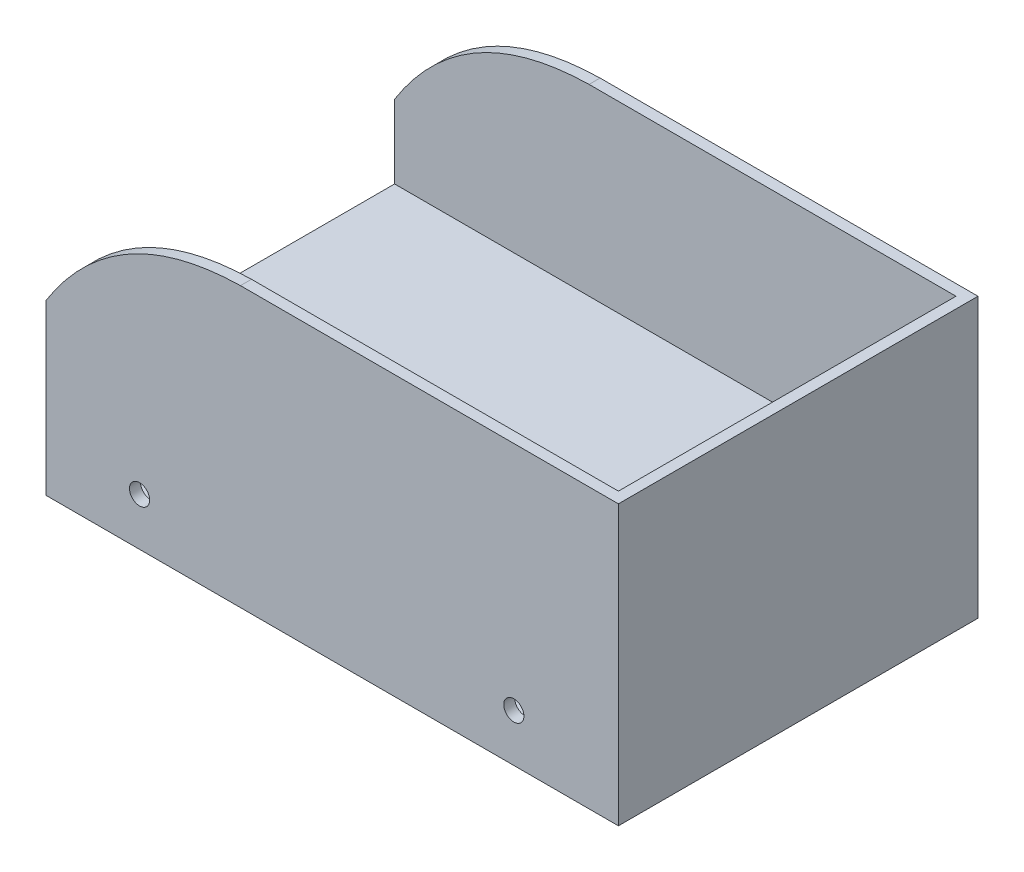
ISO-10303-21;
HEADER;
FILE_DESCRIPTION(('STEP AP214'),'2;1');
FILE_NAME('part.step','',(''),(''),'','','');
FILE_SCHEMA(('AUTOMOTIVE_DESIGN { 1 0 10303 214 1 1 1 1 }'));
ENDSEC;
DATA;
#1=APPLICATION_CONTEXT('core data for automotive mechanical design processes');
#2=APPLICATION_PROTOCOL_DEFINITION('international standard','automotive_design',2000,#1);
#3=PRODUCT_CONTEXT('',#1,'mechanical');
#4=PRODUCT('Part','Part','',(#3));
#5=PRODUCT_RELATED_PRODUCT_CATEGORY('part','',(#4));
#6=PRODUCT_DEFINITION_FORMATION('','',#4);
#7=PRODUCT_DEFINITION_CONTEXT('part definition',#1,'design');
#8=PRODUCT_DEFINITION('design','',#6,#7);
#9=PRODUCT_DEFINITION_SHAPE('','',#8);
#10=(LENGTH_UNIT() NAMED_UNIT(*) SI_UNIT(.MILLI.,.METRE.));
#11=(NAMED_UNIT(*) PLANE_ANGLE_UNIT() SI_UNIT($,.RADIAN.));
#12=(NAMED_UNIT(*) SI_UNIT($,.STERADIAN.) SOLID_ANGLE_UNIT());
#13=UNCERTAINTY_MEASURE_WITH_UNIT(LENGTH_MEASURE(1.E-05),#10,'distance_accuracy_value','');
#14=(GEOMETRIC_REPRESENTATION_CONTEXT(3) GLOBAL_UNCERTAINTY_ASSIGNED_CONTEXT((#13)) GLOBAL_UNIT_ASSIGNED_CONTEXT((#10,
#11,#12)) REPRESENTATION_CONTEXT('',''));
#15=CARTESIAN_POINT('',(0.,0.,0.));
#16=DIRECTION('',(0.,0.,1.));
#17=DIRECTION('',(1.,0.,0.));
#18=AXIS2_PLACEMENT_3D('',#15,#16,#17);
#19=CARTESIAN_POINT('',(765.,0.,0.));
#20=DIRECTION('',(-1.,0.,0.));
#21=DIRECTION('',(0.,0.,1.));
#22=AXIS2_PLACEMENT_3D('',#19,#20,#21);
#23=PLANE('',#22);
#24=DIRECTION('',(0.,-1.,0.));
#25=VECTOR('',#24,1.);
#26=CARTESIAN_POINT('',(765.,-29.9999999999998,-260.));
#27=LINE('',#26,#25);
#28=CARTESIAN_POINT('',(765.,-29.9999999999998,-260.));
#29=VERTEX_POINT('',#28);
#30=CARTESIAN_POINT('',(765.,-230.,-260.));
#31=VERTEX_POINT('',#30);
#32=EDGE_CURVE('E284',#29,#31,#27,.T.);
#33=ORIENTED_EDGE('',*,*,#32,.F.);
#34=DIRECTION('',(0.,0.,1.));
#35=VECTOR('',#34,1.);
#36=CARTESIAN_POINT('',(765.,-29.9999999999997,0.));
#37=LINE('',#36,#35);
#38=CARTESIAN_POINT('',(765.,-29.9999999999998,-660.));
#39=VERTEX_POINT('',#38);
#40=EDGE_CURVE('E338',#39,#29,#37,.T.);
#41=ORIENTED_EDGE('',*,*,#40,.F.);
#42=DIRECTION('',(0.,1.,0.));
#43=VECTOR('',#42,1.);
#44=CARTESIAN_POINT('',(765.,-29.9999999999998,-660.));
#45=LINE('',#44,#43);
#46=CARTESIAN_POINT('',(765.,-230.,-660.));
#47=VERTEX_POINT('',#46);
#48=EDGE_CURVE('E306',#47,#39,#45,.T.);
#49=ORIENTED_EDGE('',*,*,#48,.F.);
#50=DIRECTION('',(0.,0.,1.));
#51=VECTOR('',#50,1.);
#52=CARTESIAN_POINT('',(765.,-230.,30.));
#53=LINE('',#52,#51);
#54=EDGE_CURVE('E529',#47,#31,#53,.T.);
#55=ORIENTED_EDGE('',*,*,#54,.T.);
#56=EDGE_LOOP('',(#33,#41,#49,#55));
#57=FACE_BOUND('',#56,.T.);
#58=ADVANCED_FACE('F39',(#57),#23,.T.);
#59=CARTESIAN_POINT('',(0.,-230.,0.));
#60=DIRECTION('',(0.,-1.,0.));
#61=DIRECTION('',(1.,0.,0.));
#62=AXIS2_PLACEMENT_3D('',#59,#60,#61);
#63=PLANE('',#62);
#64=DIRECTION('',(1.,0.,0.));
#65=VECTOR('',#64,1.);
#66=CARTESIAN_POINT('',(-35.,-230.,-405.));
#67=LINE('',#66,#65);
#68=CARTESIAN_POINT('',(-35.,-230.,-405.));
#69=VERTEX_POINT('',#68);
#70=CARTESIAN_POINT('',(265.,-230.,-405.));
#71=VERTEX_POINT('',#70);
#72=EDGE_CURVE('E61',#69,#71,#67,.T.);
#73=ORIENTED_EDGE('',*,*,#72,.F.);
#74=DIRECTION('',(0.,0.,1.));
#75=VECTOR('',#74,1.);
#76=CARTESIAN_POINT('',(-35.,-230.,-515.));
#77=LINE('',#76,#75);
#78=CARTESIAN_POINT('',(-35.,-230.,-515.));
#79=VERTEX_POINT('',#78);
#80=EDGE_CURVE('E56',#79,#69,#77,.T.);
#81=ORIENTED_EDGE('',*,*,#80,.F.);
#82=DIRECTION('',(1.,0.,0.));
#83=VECTOR('',#82,1.);
#84=CARTESIAN_POINT('',(-35.,-230.,-515.));
#85=LINE('',#84,#83);
#86=CARTESIAN_POINT('',(265.,-230.,-515.));
#87=VERTEX_POINT('',#86);
#88=EDGE_CURVE('E245',#79,#87,#85,.T.);
#89=ORIENTED_EDGE('',*,*,#88,.T.);
#90=DIRECTION('',(0.,0.,1.));
#91=VECTOR('',#90,1.);
#92=CARTESIAN_POINT('',(265.,-230.,-515.));
#93=LINE('',#92,#91);
#94=EDGE_CURVE('E238',#87,#71,#93,.T.);
#95=ORIENTED_EDGE('',*,*,#94,.T.);
#96=EDGE_LOOP('',(#73,#81,#89,#95));
#97=FACE_BOUND('',#96,.T.);
#98=DIRECTION('',(0.,0.,-1.));
#99=VECTOR('',#98,1.);
#100=CARTESIAN_POINT('',(-765.,-230.,30.));
#101=LINE('',#100,#99);
#102=CARTESIAN_POINT('',(-765.,-230.,-260.));
#103=VERTEX_POINT('',#102);
#104=CARTESIAN_POINT('',(-765.,-230.,-660.));
#105=VERTEX_POINT('',#104);
#106=EDGE_CURVE('E526',#103,#105,#101,.T.);
#107=ORIENTED_EDGE('',*,*,#106,.F.);
#108=DIRECTION('',(-1.,0.,0.));
#109=VECTOR('',#108,1.);
#110=CARTESIAN_POINT('',(765.,-230.,-260.));
#111=LINE('',#110,#109);
#112=EDGE_CURVE('E289',#31,#103,#111,.T.);
#113=ORIENTED_EDGE('',*,*,#112,.F.);
#114=ORIENTED_EDGE('',*,*,#54,.F.);
#115=DIRECTION('',(-1.,0.,0.));
#116=VECTOR('',#115,1.);
#117=CARTESIAN_POINT('',(765.,-230.,-660.));
#118=LINE('',#117,#116);
#119=EDGE_CURVE('E320',#47,#105,#118,.T.);
#120=ORIENTED_EDGE('',*,*,#119,.T.);
#121=EDGE_LOOP('',(#107,#113,#114,#120));
#122=FACE_BOUND('',#121,.T.);
#123=ADVANCED_FACE('F397',(#97,#122),#63,.F.);
#124=CARTESIAN_POINT('',(-765.,-29.9999999999997,0.));
#125=DIRECTION('',(0.,1.,0.));
#126=DIRECTION('',(0.,0.,1.));
#127=AXIS2_PLACEMENT_3D('',#124,#125,#126);
#128=PLANE('',#127);
#129=ORIENTED_EDGE('',*,*,#40,.T.);
#130=DIRECTION('',(-1.,0.,0.));
#131=VECTOR('',#130,1.);
#132=CARTESIAN_POINT('',(765.,-29.9999999999998,-260.));
#133=LINE('',#132,#131);
#134=CARTESIAN_POINT('',(-765.,-29.9999999999998,-260.));
#135=VERTEX_POINT('',#134);
#136=EDGE_CURVE('E293',#29,#135,#133,.T.);
#137=ORIENTED_EDGE('',*,*,#136,.T.);
#138=DIRECTION('',(0.,0.,1.));
#139=VECTOR('',#138,1.);
#140=CARTESIAN_POINT('',(-765.,-29.9999999999997,0.));
#141=LINE('',#140,#139);
#142=CARTESIAN_POINT('',(-765.,-29.9999999999998,-660.));
#143=VERTEX_POINT('',#142);
#144=EDGE_CURVE('E333',#143,#135,#141,.T.);
#145=ORIENTED_EDGE('',*,*,#144,.F.);
#146=DIRECTION('',(-1.,0.,0.));
#147=VECTOR('',#146,1.);
#148=CARTESIAN_POINT('',(765.,-29.9999999999998,-660.));
#149=LINE('',#148,#147);
#150=EDGE_CURVE('E317',#39,#143,#149,.T.);
#151=ORIENTED_EDGE('',*,*,#150,.F.);
#152=EDGE_LOOP('',(#129,#137,#145,#151));
#153=FACE_BOUND('',#152,.T.);
#154=ADVANCED_FACE('F569',(#153),#128,.F.);
#155=DIRECTION('',(0.,-1.,0.));
#156=VECTOR('',#155,1.);
#157=CARTESIAN_POINT('',(765.,-29.9999999999998,-680.));
#158=LINE('',#157,#156);
#159=CARTESIAN_POINT('',(765.,-29.9999999999998,-680.));
#160=VERTEX_POINT('',#159);
#161=CARTESIAN_POINT('',(765.,-230.,-680.));
#162=VERTEX_POINT('',#161);
#163=EDGE_CURVE('E304',#160,#162,#158,.T.);
#164=ORIENTED_EDGE('',*,*,#163,.F.);
#165=CARTESIAN_POINT('',(765.,-29.9999999999998,-920.));
#166=VERTEX_POINT('',#165);
#167=EDGE_CURVE('E328',#166,#160,#37,.T.);
#168=ORIENTED_EDGE('',*,*,#167,.F.);
#169=DIRECTION('',(0.,1.,0.));
#170=VECTOR('',#169,1.);
#171=CARTESIAN_POINT('',(765.,0.,-920.));
#172=LINE('',#171,#170);
#173=CARTESIAN_POINT('',(765.,-230.,-920.));
#174=VERTEX_POINT('',#173);
#175=EDGE_CURVE('E476',#174,#166,#172,.T.);
#176=ORIENTED_EDGE('',*,*,#175,.F.);
#177=EDGE_CURVE('E517',#174,#162,#53,.T.);
#178=ORIENTED_EDGE('',*,*,#177,.T.);
#179=EDGE_LOOP('',(#164,#168,#176,#178));
#180=FACE_BOUND('',#179,.T.);
#181=ADVANCED_FACE('F592',(#180),#23,.T.);
#182=CARTESIAN_POINT('',(-765.,-230.,-680.));
#183=VERTEX_POINT('',#182);
#184=CARTESIAN_POINT('',(-765.,-230.,-920.));
#185=VERTEX_POINT('',#184);
#186=EDGE_CURVE('E512',#183,#185,#101,.T.);
#187=ORIENTED_EDGE('',*,*,#186,.F.);
#188=DIRECTION('',(-1.,0.,0.));
#189=VECTOR('',#188,1.);
#190=CARTESIAN_POINT('',(765.,-230.,-680.));
#191=LINE('',#190,#189);
#192=EDGE_CURVE('E309',#162,#183,#191,.T.);
#193=ORIENTED_EDGE('',*,*,#192,.F.);
#194=ORIENTED_EDGE('',*,*,#177,.F.);
#195=DIRECTION('',(1.,0.,0.));
#196=VECTOR('',#195,1.);
#197=CARTESIAN_POINT('',(0.,-230.,-920.));
#198=LINE('',#197,#196);
#199=EDGE_CURVE('E479',#185,#174,#198,.T.);
#200=ORIENTED_EDGE('',*,*,#199,.F.);
#201=EDGE_LOOP('',(#187,#193,#194,#200));
#202=FACE_BOUND('',#201,.T.);
#203=ADVANCED_FACE('F398',(#202),#63,.F.);
#204=ORIENTED_EDGE('',*,*,#167,.T.);
#205=DIRECTION('',(-1.,0.,0.));
#206=VECTOR('',#205,1.);
#207=CARTESIAN_POINT('',(765.,-29.9999999999998,-680.));
#208=LINE('',#207,#206);
#209=CARTESIAN_POINT('',(-765.,-29.9999999999998,-680.));
#210=VERTEX_POINT('',#209);
#211=EDGE_CURVE('E313',#160,#210,#208,.T.);
#212=ORIENTED_EDGE('',*,*,#211,.T.);
#213=CARTESIAN_POINT('',(-765.,-29.9999999999998,-920.));
#214=VERTEX_POINT('',#213);
#215=EDGE_CURVE('E329',#214,#210,#141,.T.);
#216=ORIENTED_EDGE('',*,*,#215,.F.);
#217=DIRECTION('',(1.,0.,0.));
#218=VECTOR('',#217,1.);
#219=CARTESIAN_POINT('',(-765.,-29.9999999999998,-920.));
#220=LINE('',#219,#218);
#221=EDGE_CURVE('E341',#214,#166,#220,.T.);
#222=ORIENTED_EDGE('',*,*,#221,.T.);
#223=EDGE_LOOP('',(#204,#212,#216,#222));
#224=FACE_BOUND('',#223,.T.);
#225=ADVANCED_FACE('F386',(#224),#128,.F.);
#226=CARTESIAN_POINT('',(765.,1.64888250634733E-13,-920.));
#227=VERTEX_POINT('',#226);
#228=CARTESIAN_POINT('',(765.,500.,-920.));
#229=VERTEX_POINT('',#228);
#230=EDGE_CURVE('E471',#227,#229,#172,.T.);
#231=ORIENTED_EDGE('',*,*,#230,.F.);
#232=DIRECTION('',(0.,0.,-1.));
#233=VECTOR('',#232,1.);
#234=CARTESIAN_POINT('',(765.,0.,0.));
#235=LINE('',#234,#233);
#236=CARTESIAN_POINT('',(765.,0.,0.));
#237=VERTEX_POINT('',#236);
#238=EDGE_CURVE('E316',#237,#227,#235,.T.);
#239=ORIENTED_EDGE('',*,*,#238,.F.);
#240=DIRECTION('',(0.,1.,0.));
#241=VECTOR('',#240,1.);
#242=CARTESIAN_POINT('',(765.,0.,0.));
#243=LINE('',#242,#241);
#244=CARTESIAN_POINT('',(765.,500.,0.));
#245=VERTEX_POINT('',#244);
#246=EDGE_CURVE('E459',#237,#245,#243,.T.);
#247=ORIENTED_EDGE('',*,*,#246,.T.);
#248=DIRECTION('',(0.,0.,1.));
#249=VECTOR('',#248,1.);
#250=CARTESIAN_POINT('',(765.,500.,30.));
#251=LINE('',#250,#249);
#252=EDGE_CURVE('E496',#229,#245,#251,.T.);
#253=ORIENTED_EDGE('',*,*,#252,.F.);
#254=EDGE_LOOP('',(#231,#239,#247,#253));
#255=FACE_BOUND('',#254,.T.);
#256=ADVANCED_FACE('F382',(#255),#23,.T.);
#257=DIRECTION('',(0.,1.,0.));
#258=VECTOR('',#257,1.);
#259=CARTESIAN_POINT('',(765.,-29.9999999999998,-240.));
#260=LINE('',#259,#258);
#261=CARTESIAN_POINT('',(765.,-230.,-240.));
#262=VERTEX_POINT('',#261);
#263=CARTESIAN_POINT('',(765.,-29.9999999999998,-240.));
#264=VERTEX_POINT('',#263);
#265=EDGE_CURVE('E286',#262,#264,#260,.T.);
#266=ORIENTED_EDGE('',*,*,#265,.F.);
#267=CARTESIAN_POINT('',(765.,-230.,0.));
#268=VERTEX_POINT('',#267);
#269=EDGE_CURVE('E525',#262,#268,#53,.T.);
#270=ORIENTED_EDGE('',*,*,#269,.T.);
#271=CARTESIAN_POINT('',(765.,-29.9999999999997,0.));
#272=VERTEX_POINT('',#271);
#273=EDGE_CURVE('E460',#268,#272,#243,.T.);
#274=ORIENTED_EDGE('',*,*,#273,.T.);
#275=EDGE_CURVE('E335',#264,#272,#37,.T.);
#276=ORIENTED_EDGE('',*,*,#275,.F.);
#277=EDGE_LOOP('',(#266,#270,#274,#276));
#278=FACE_BOUND('',#277,.T.);
#279=ADVANCED_FACE('F385',(#278),#23,.T.);
#280=CARTESIAN_POINT('',(0.,0.,0.));
#281=DIRECTION('',(0.,0.,1.));
#282=DIRECTION('',(1.,0.,0.));
#283=AXIS2_PLACEMENT_3D('',#280,#281,#282);
#284=PLANE('',#283);
#285=DIRECTION('',(1.,0.,0.));
#286=VECTOR('',#285,1.);
#287=CARTESIAN_POINT('',(-765.,0.,0.));
#288=LINE('',#287,#286);
#289=CARTESIAN_POINT('',(-765.,0.,0.));
#290=VERTEX_POINT('',#289);
#291=EDGE_CURVE('E346',#290,#237,#288,.T.);
#292=ORIENTED_EDGE('',*,*,#291,.F.);
#293=DIRECTION('',(0.,1.,0.));
#294=VECTOR('',#293,1.);
#295=CARTESIAN_POINT('',(-765.,0.,0.));
#296=LINE('',#295,#294);
#297=CARTESIAN_POINT('',(-765.,200.,0.));
#298=VERTEX_POINT('',#297);
#299=EDGE_CURVE('E449',#290,#298,#296,.T.);
#300=ORIENTED_EDGE('',*,*,#299,.T.);
#301=CARTESIAN_POINT('',(-235.,500.,0.));
#302=CARTESIAN_POINT('',(-580.943747407321,493.324844820459,0.));
#303=CARTESIAN_POINT('',(-765.,200.,0.));
#304=B_SPLINE_CURVE_WITH_KNOTS('',2,(#301,#302,#303),.UNSPECIFIED.,.F.,.F.,(3,3),(0.,1.),.UNSPECIFIED.);
#305=CARTESIAN_POINT('',(-235.,500.,0.));
#306=VERTEX_POINT('',#305);
#307=EDGE_CURVE('E443',#306,#298,#304,.T.);
#308=ORIENTED_EDGE('',*,*,#307,.F.);
#309=DIRECTION('',(-1.,0.,0.));
#310=VECTOR('',#309,1.);
#311=CARTESIAN_POINT('',(0.,500.,0.));
#312=LINE('',#311,#310);
#313=EDGE_CURVE('E440',#245,#306,#312,.T.);
#314=ORIENTED_EDGE('',*,*,#313,.F.);
#315=ORIENTED_EDGE('',*,*,#246,.F.);
#316=EDGE_LOOP('',(#292,#300,#308,#314,#315));
#317=FACE_BOUND('',#316,.T.);
#318=ADVANCED_FACE('F415',(#317),#284,.F.);
#319=CARTESIAN_POINT('',(510.,-130.,0.));
#320=DIRECTION('',(0.,0.,1.));
#321=DIRECTION('',(1.,0.,0.));
#322=AXIS2_PLACEMENT_3D('',#319,#320,#321);
#323=CIRCLE('',#322,27.4999999999999);
#324=CARTESIAN_POINT('',(537.5,-130.,0.));
#325=VERTEX_POINT('',#324);
#326=EDGE_CURVE('E537',#325,#325,#323,.T.);
#327=ORIENTED_EDGE('',*,*,#326,.T.);
#328=EDGE_LOOP('',(#327));
#329=FACE_BOUND('',#328,.T.);
#330=CARTESIAN_POINT('',(-510.,-130.,0.));
#331=DIRECTION('',(0.,0.,1.));
#332=DIRECTION('',(1.,0.,0.));
#333=AXIS2_PLACEMENT_3D('',#330,#331,#332);
#334=CIRCLE('',#333,27.5);
#335=CARTESIAN_POINT('',(-482.5,-130.,0.));
#336=VERTEX_POINT('',#335);
#337=EDGE_CURVE('E444',#336,#336,#334,.T.);
#338=ORIENTED_EDGE('',*,*,#337,.T.);
#339=EDGE_LOOP('',(#338));
#340=FACE_BOUND('',#339,.T.);
#341=DIRECTION('',(1.,0.,0.));
#342=VECTOR('',#341,1.);
#343=CARTESIAN_POINT('',(-765.,-29.9999999999997,0.));
#344=LINE('',#343,#342);
#345=CARTESIAN_POINT('',(-765.,-29.9999999999997,0.));
#346=VERTEX_POINT('',#345);
#347=EDGE_CURVE('E332',#346,#272,#344,.T.);
#348=ORIENTED_EDGE('',*,*,#347,.T.);
#349=ORIENTED_EDGE('',*,*,#273,.F.);
#350=DIRECTION('',(1.,0.,0.));
#351=VECTOR('',#350,1.);
#352=CARTESIAN_POINT('',(0.,-230.,0.));
#353=LINE('',#352,#351);
#354=CARTESIAN_POINT('',(-765.,-230.,0.));
#355=VERTEX_POINT('',#354);
#356=EDGE_CURVE('E456',#355,#268,#353,.T.);
#357=ORIENTED_EDGE('',*,*,#356,.F.);
#358=EDGE_CURVE('E450',#355,#346,#296,.T.);
#359=ORIENTED_EDGE('',*,*,#358,.T.);
#360=EDGE_LOOP('',(#348,#349,#357,#359));
#361=FACE_BOUND('',#360,.T.);
#362=ADVANCED_FACE('F418',(#329,#340,#361),#284,.F.);
#363=CARTESIAN_POINT('',(0.,0.,-920.));
#364=DIRECTION('',(0.,0.,-1.));
#365=DIRECTION('',(1.,0.,0.));
#366=AXIS2_PLACEMENT_3D('',#363,#364,#365);
#367=PLANE('',#366);
#368=DIRECTION('',(1.,0.,0.));
#369=VECTOR('',#368,1.);
#370=CARTESIAN_POINT('',(-765.,1.64888250634733E-13,-920.));
#371=LINE('',#370,#369);
#372=CARTESIAN_POINT('',(-765.,1.6488825101241E-13,-920.));
#373=VERTEX_POINT('',#372);
#374=EDGE_CURVE('E343',#373,#227,#371,.T.);
#375=ORIENTED_EDGE('',*,*,#374,.T.);
#376=ORIENTED_EDGE('',*,*,#230,.T.);
#377=DIRECTION('',(-1.,0.,0.));
#378=VECTOR('',#377,1.);
#379=CARTESIAN_POINT('',(0.,500.,-920.));
#380=LINE('',#379,#378);
#381=CARTESIAN_POINT('',(-235.,500.,-920.));
#382=VERTEX_POINT('',#381);
#383=EDGE_CURVE('E363',#229,#382,#380,.T.);
#384=ORIENTED_EDGE('',*,*,#383,.T.);
#385=CARTESIAN_POINT('',(-235.,500.,-920.));
#386=CARTESIAN_POINT('',(-580.943747407321,493.324844820459,-920.));
#387=CARTESIAN_POINT('',(-765.,200.,-920.));
#388=B_SPLINE_CURVE_WITH_KNOTS('',2,(#385,#386,#387),.UNSPECIFIED.,.F.,.F.,(3,3),(0.,1.),.UNSPECIFIED.);
#389=CARTESIAN_POINT('',(-765.,200.,-920.));
#390=VERTEX_POINT('',#389);
#391=EDGE_CURVE('E362',#382,#390,#388,.T.);
#392=ORIENTED_EDGE('',*,*,#391,.T.);
#393=DIRECTION('',(0.,1.,0.));
#394=VECTOR('',#393,1.);
#395=CARTESIAN_POINT('',(-765.,0.,-920.));
#396=LINE('',#395,#394);
#397=EDGE_CURVE('E482',#373,#390,#396,.T.);
#398=ORIENTED_EDGE('',*,*,#397,.F.);
#399=EDGE_LOOP('',(#375,#376,#384,#392,#398));
#400=FACE_BOUND('',#399,.T.);
#401=ADVANCED_FACE('F376',(#400),#367,.F.);
#402=CARTESIAN_POINT('',(510.,-130.,-920.));
#403=DIRECTION('',(0.,0.,-1.));
#404=DIRECTION('',(-1.,0.,0.));
#405=AXIS2_PLACEMENT_3D('',#402,#403,#404);
#406=CIRCLE('',#405,27.4999999999999);
#407=CARTESIAN_POINT('',(482.5,-130.,-920.));
#408=VERTEX_POINT('',#407);
#409=EDGE_CURVE('E352',#408,#408,#406,.F.);
#410=ORIENTED_EDGE('',*,*,#409,.F.);
#411=EDGE_LOOP('',(#410));
#412=FACE_BOUND('',#411,.T.);
#413=CARTESIAN_POINT('',(-510.,-130.,-920.));
#414=DIRECTION('',(0.,0.,-1.));
#415=DIRECTION('',(-1.,0.,0.));
#416=AXIS2_PLACEMENT_3D('',#413,#414,#415);
#417=CIRCLE('',#416,27.5);
#418=CARTESIAN_POINT('',(-537.5,-130.,-920.));
#419=VERTEX_POINT('',#418);
#420=EDGE_CURVE('E43',#419,#419,#417,.F.);
#421=ORIENTED_EDGE('',*,*,#420,.F.);
#422=EDGE_LOOP('',(#421));
#423=FACE_BOUND('',#422,.T.);
#424=ORIENTED_EDGE('',*,*,#221,.F.);
#425=EDGE_CURVE('E483',#185,#214,#396,.T.);
#426=ORIENTED_EDGE('',*,*,#425,.F.);
#427=ORIENTED_EDGE('',*,*,#199,.T.);
#428=ORIENTED_EDGE('',*,*,#175,.T.);
#429=EDGE_LOOP('',(#424,#426,#427,#428));
#430=FACE_BOUND('',#429,.T.);
#431=ADVANCED_FACE('F395',(#412,#423,#430),#367,.F.);
#432=ORIENTED_EDGE('',*,*,#269,.F.);
#433=DIRECTION('',(-1.,0.,0.));
#434=VECTOR('',#433,1.);
#435=CARTESIAN_POINT('',(765.,-230.,-240.));
#436=LINE('',#435,#434);
#437=CARTESIAN_POINT('',(-765.,-230.,-240.));
#438=VERTEX_POINT('',#437);
#439=EDGE_CURVE('E300',#262,#438,#436,.T.);
#440=ORIENTED_EDGE('',*,*,#439,.T.);
#441=EDGE_CURVE('E522',#355,#438,#101,.T.);
#442=ORIENTED_EDGE('',*,*,#441,.F.);
#443=ORIENTED_EDGE('',*,*,#356,.T.);
#444=EDGE_LOOP('',(#432,#440,#442,#443));
#445=FACE_BOUND('',#444,.T.);
#446=ADVANCED_FACE('F392',(#445),#63,.F.);
#447=CARTESIAN_POINT('',(0.,500.,30.));
#448=DIRECTION('',(0.,-1.,0.));
#449=DIRECTION('',(1.,0.,0.));
#450=AXIS2_PLACEMENT_3D('',#447,#448,#449);
#451=PLANE('',#450);
#452=ORIENTED_EDGE('',*,*,#383,.F.);
#453=ORIENTED_EDGE('',*,*,#252,.T.);
#454=ORIENTED_EDGE('',*,*,#313,.T.);
#455=DIRECTION('',(0.,0.,-1.));
#456=VECTOR('',#455,1.);
#457=CARTESIAN_POINT('',(-235.,500.,30.));
#458=LINE('',#457,#456);
#459=CARTESIAN_POINT('',(-235.,500.,30.));
#460=VERTEX_POINT('',#459);
#461=EDGE_CURVE('E11',#460,#306,#458,.T.);
#462=ORIENTED_EDGE('',*,*,#461,.F.);
#463=DIRECTION('',(-1.,0.,0.));
#464=VECTOR('',#463,1.);
#465=CARTESIAN_POINT('',(0.,500.,30.));
#466=LINE('',#465,#464);
#467=CARTESIAN_POINT('',(795.,500.,30.));
#468=VERTEX_POINT('',#467);
#469=EDGE_CURVE('E433',#468,#460,#466,.T.);
#470=ORIENTED_EDGE('',*,*,#469,.F.);
#471=DIRECTION('',(0.,0.,1.));
#472=VECTOR('',#471,1.);
#473=CARTESIAN_POINT('',(795.,500.,30.));
#474=LINE('',#473,#472);
#475=CARTESIAN_POINT('',(795.,500.,-950.));
#476=VERTEX_POINT('',#475);
#477=EDGE_CURVE('E505',#476,#468,#474,.T.);
#478=ORIENTED_EDGE('',*,*,#477,.F.);
#479=DIRECTION('',(-1.,0.,0.));
#480=VECTOR('',#479,1.);
#481=CARTESIAN_POINT('',(795.,500.,-950.));
#482=LINE('',#481,#480);
#483=CARTESIAN_POINT('',(-235.,500.,-950.));
#484=VERTEX_POINT('',#483);
#485=EDGE_CURVE('E508',#476,#484,#482,.T.);
#486=ORIENTED_EDGE('',*,*,#485,.T.);
#487=DIRECTION('',(0.,0.,1.));
#488=VECTOR('',#487,1.);
#489=CARTESIAN_POINT('',(-235.,500.,-950.));
#490=LINE('',#489,#488);
#491=EDGE_CURVE('E361',#484,#382,#490,.T.);
#492=ORIENTED_EDGE('',*,*,#491,.T.);
#493=EDGE_LOOP('',(#452,#453,#454,#462,#470,#478,#486,#492));
#494=FACE_BOUND('',#493,.T.);
#495=ADVANCED_FACE('F41',(#494),#451,.F.);
#496=CARTESIAN_POINT('',(-235.,500.,30.));
#497=CARTESIAN_POINT('',(-580.943747407321,493.324844820459,30.));
#498=CARTESIAN_POINT('',(-765.,200.,30.));
#499=B_SPLINE_CURVE_WITH_KNOTS('',2,(#496,#497,#498),.UNSPECIFIED.,.F.,.F.,(3,3),(0.,1.),.UNSPECIFIED.);
#500=DIRECTION('',(0.,0.,-1.));
#501=VECTOR('',#500,1.);
#502=SURFACE_OF_LINEAR_EXTRUSION('',#499,#501);
#503=ORIENTED_EDGE('',*,*,#307,.T.);
#504=DIRECTION('',(0.,0.,-1.));
#505=VECTOR('',#504,1.);
#506=CARTESIAN_POINT('',(-765.,200.,30.));
#507=LINE('',#506,#505);
#508=CARTESIAN_POINT('',(-765.,200.,30.));
#509=VERTEX_POINT('',#508);
#510=EDGE_CURVE('E48',#509,#298,#507,.T.);
#511=ORIENTED_EDGE('',*,*,#510,.F.);
#512=EDGE_CURVE('E426',#460,#509,#499,.T.);
#513=ORIENTED_EDGE('',*,*,#512,.F.);
#514=ORIENTED_EDGE('',*,*,#461,.T.);
#515=EDGE_LOOP('',(#503,#511,#513,#514));
#516=FACE_BOUND('',#515,.T.);
#517=ADVANCED_FACE('F421',(#516),#502,.F.);
#518=CARTESIAN_POINT('',(-765.,0.,30.));
#519=DIRECTION('',(-1.,0.,0.));
#520=DIRECTION('',(0.,0.,1.));
#521=AXIS2_PLACEMENT_3D('',#518,#519,#520);
#522=PLANE('',#521);
#523=ORIENTED_EDGE('',*,*,#441,.T.);
#524=DIRECTION('',(0.,1.,0.));
#525=VECTOR('',#524,1.);
#526=CARTESIAN_POINT('',(-765.,-29.9999999999998,-240.));
#527=LINE('',#526,#525);
#528=CARTESIAN_POINT('',(-765.,-29.9999999999997,-240.));
#529=VERTEX_POINT('',#528);
#530=EDGE_CURVE('E287',#438,#529,#527,.T.);
#531=ORIENTED_EDGE('',*,*,#530,.T.);
#532=EDGE_CURVE('E327',#529,#346,#141,.T.);
#533=ORIENTED_EDGE('',*,*,#532,.T.);
#534=ORIENTED_EDGE('',*,*,#358,.F.);
#535=EDGE_LOOP('',(#523,#531,#533,#534));
#536=FACE_BOUND('',#535,.T.);
#537=DIRECTION('',(0.,-1.,0.));
#538=VECTOR('',#537,1.);
#539=CARTESIAN_POINT('',(-765.,-29.9999999999998,-260.));
#540=LINE('',#539,#538);
#541=EDGE_CURVE('E283',#135,#103,#540,.T.);
#542=ORIENTED_EDGE('',*,*,#541,.T.);
#543=ORIENTED_EDGE('',*,*,#106,.T.);
#544=DIRECTION('',(0.,1.,0.));
#545=VECTOR('',#544,1.);
#546=CARTESIAN_POINT('',(-765.,-29.9999999999998,-660.));
#547=LINE('',#546,#545);
#548=EDGE_CURVE('E307',#105,#143,#547,.T.);
#549=ORIENTED_EDGE('',*,*,#548,.T.);
#550=ORIENTED_EDGE('',*,*,#144,.T.);
#551=EDGE_LOOP('',(#542,#543,#549,#550));
#552=FACE_BOUND('',#551,.T.);
#553=ORIENTED_EDGE('',*,*,#299,.F.);
#554=DIRECTION('',(0.,0.,-1.));
#555=VECTOR('',#554,1.);
#556=CARTESIAN_POINT('',(-765.,0.,0.));
#557=LINE('',#556,#555);
#558=EDGE_CURVE('E324',#290,#373,#557,.T.);
#559=ORIENTED_EDGE('',*,*,#558,.T.);
#560=ORIENTED_EDGE('',*,*,#397,.T.);
#561=DIRECTION('',(0.,0.,1.));
#562=VECTOR('',#561,1.);
#563=CARTESIAN_POINT('',(-765.,200.,-950.));
#564=LINE('',#563,#562);
#565=CARTESIAN_POINT('',(-765.,200.,-950.));
#566=VERTEX_POINT('',#565);
#567=EDGE_CURVE('E493',#566,#390,#564,.T.);
#568=ORIENTED_EDGE('',*,*,#567,.F.);
#569=DIRECTION('',(0.,1.,0.));
#570=VECTOR('',#569,1.);
#571=CARTESIAN_POINT('',(-765.,-260.,-950.));
#572=LINE('',#571,#570);
#573=CARTESIAN_POINT('',(-765.,-260.,-950.));
#574=VERTEX_POINT('',#573);
#575=EDGE_CURVE('E521',#574,#566,#572,.T.);
#576=ORIENTED_EDGE('',*,*,#575,.F.);
#577=DIRECTION('',(0.,0.,-1.));
#578=VECTOR('',#577,1.);
#579=CARTESIAN_POINT('',(-765.,-260.,30.));
#580=LINE('',#579,#578);
#581=CARTESIAN_POINT('',(-765.,-260.,30.));
#582=VERTEX_POINT('',#581);
#583=EDGE_CURVE('E513',#582,#574,#580,.T.);
#584=ORIENTED_EDGE('',*,*,#583,.F.);
#585=DIRECTION('',(0.,1.,0.));
#586=VECTOR('',#585,1.);
#587=CARTESIAN_POINT('',(-765.,0.,30.));
#588=LINE('',#587,#586);
#589=EDGE_CURVE('E432',#582,#509,#588,.T.);
#590=ORIENTED_EDGE('',*,*,#589,.T.);
#591=ORIENTED_EDGE('',*,*,#510,.T.);
#592=EDGE_LOOP('',(#553,#559,#560,#568,#576,#584,#590,#591));
#593=FACE_BOUND('',#592,.T.);
#594=DIRECTION('',(0.,-1.,0.));
#595=VECTOR('',#594,1.);
#596=CARTESIAN_POINT('',(-765.,-29.9999999999998,-680.));
#597=LINE('',#596,#595);
#598=EDGE_CURVE('E296',#210,#183,#597,.T.);
#599=ORIENTED_EDGE('',*,*,#598,.T.);
#600=ORIENTED_EDGE('',*,*,#186,.T.);
#601=ORIENTED_EDGE('',*,*,#425,.T.);
#602=ORIENTED_EDGE('',*,*,#215,.T.);
#603=EDGE_LOOP('',(#599,#600,#601,#602));
#604=FACE_BOUND('',#603,.T.);
#605=ADVANCED_FACE('F413',(#536,#552,#593,#604),#522,.T.);
#606=CARTESIAN_POINT('',(0.,0.,30.));
#607=DIRECTION('',(0.,0.,1.));
#608=DIRECTION('',(1.,0.,0.));
#609=AXIS2_PLACEMENT_3D('',#606,#607,#608);
#610=PLANE('',#609);
#611=ORIENTED_EDGE('',*,*,#589,.F.);
#612=DIRECTION('',(-1.,0.,0.));
#613=VECTOR('',#612,1.);
#614=CARTESIAN_POINT('',(-765.,-260.,30.));
#615=LINE('',#614,#613);
#616=CARTESIAN_POINT('',(795.,-260.,30.));
#617=VERTEX_POINT('',#616);
#618=EDGE_CURVE('E519',#617,#582,#615,.T.);
#619=ORIENTED_EDGE('',*,*,#618,.F.);
#620=DIRECTION('',(0.,-1.,0.));
#621=VECTOR('',#620,1.);
#622=CARTESIAN_POINT('',(795.,-260.,30.));
#623=LINE('',#622,#621);
#624=EDGE_CURVE('E497',#468,#617,#623,.T.);
#625=ORIENTED_EDGE('',*,*,#624,.F.);
#626=ORIENTED_EDGE('',*,*,#469,.T.);
#627=ORIENTED_EDGE('',*,*,#512,.T.);
#628=EDGE_LOOP('',(#611,#619,#625,#626,#627));
#629=FACE_BOUND('',#628,.T.);
#630=CARTESIAN_POINT('',(-510.,-130.,30.));
#631=DIRECTION('',(0.,0.,1.));
#632=DIRECTION('',(1.,0.,0.));
#633=AXIS2_PLACEMENT_3D('',#630,#631,#632);
#634=CIRCLE('',#633,27.5);
#635=CARTESIAN_POINT('',(-482.5,-130.,30.));
#636=VERTEX_POINT('',#635);
#637=EDGE_CURVE('E534',#636,#636,#634,.T.);
#638=ORIENTED_EDGE('',*,*,#637,.F.);
#639=EDGE_LOOP('',(#638));
#640=FACE_BOUND('',#639,.T.);
#641=CARTESIAN_POINT('',(510.,-130.,30.));
#642=DIRECTION('',(0.,0.,1.));
#643=DIRECTION('',(1.,0.,0.));
#644=AXIS2_PLACEMENT_3D('',#641,#642,#643);
#645=CIRCLE('',#644,27.4999999999999);
#646=CARTESIAN_POINT('',(537.5,-130.,30.));
#647=VERTEX_POINT('',#646);
#648=EDGE_CURVE('E531',#647,#647,#645,.T.);
#649=ORIENTED_EDGE('',*,*,#648,.F.);
#650=EDGE_LOOP('',(#649));
#651=FACE_BOUND('',#650,.T.);
#652=ADVANCED_FACE('F409',(#629,#640,#651),#610,.T.);
#653=CARTESIAN_POINT('',(510.,-130.,0.));
#654=DIRECTION('',(0.,0.,1.));
#655=DIRECTION('',(1.,0.,0.));
#656=AXIS2_PLACEMENT_3D('',#653,#654,#655);
#657=CYLINDRICAL_SURFACE('',#656,27.4999999999999);
#658=ORIENTED_EDGE('',*,*,#326,.F.);
#659=EDGE_LOOP('',(#658));
#660=FACE_BOUND('',#659,.T.);
#661=ORIENTED_EDGE('',*,*,#648,.T.);
#662=EDGE_LOOP('',(#661));
#663=FACE_BOUND('',#662,.T.);
#664=ADVANCED_FACE('F405',(#660,#663),#657,.F.);
#665=CARTESIAN_POINT('',(-510.,-130.,0.));
#666=DIRECTION('',(0.,0.,1.));
#667=DIRECTION('',(1.,0.,0.));
#668=AXIS2_PLACEMENT_3D('',#665,#666,#667);
#669=CYLINDRICAL_SURFACE('',#668,27.5);
#670=ORIENTED_EDGE('',*,*,#337,.F.);
#671=EDGE_LOOP('',(#670));
#672=FACE_BOUND('',#671,.T.);
#673=ORIENTED_EDGE('',*,*,#637,.T.);
#674=EDGE_LOOP('',(#673));
#675=FACE_BOUND('',#674,.T.);
#676=ADVANCED_FACE('F401',(#672,#675),#669,.F.);
#677=CARTESIAN_POINT('',(-765.,-260.,-950.));
#678=DIRECTION('',(0.,0.,1.));
#679=DIRECTION('',(1.,0.,0.));
#680=AXIS2_PLACEMENT_3D('',#677,#678,#679);
#681=PLANE('',#680);
#682=CARTESIAN_POINT('',(-510.,-130.,-950.));
#683=DIRECTION('',(0.,0.,1.));
#684=DIRECTION('',(1.,0.,0.));
#685=AXIS2_PLACEMENT_3D('',#682,#683,#684);
#686=CIRCLE('',#685,27.5);
#687=CARTESIAN_POINT('',(-482.5,-130.,-950.));
#688=VERTEX_POINT('',#687);
#689=EDGE_CURVE('E349',#688,#688,#686,.T.);
#690=ORIENTED_EDGE('',*,*,#689,.T.);
#691=EDGE_LOOP('',(#690));
#692=FACE_BOUND('',#691,.T.);
#693=CARTESIAN_POINT('',(510.,-130.,-950.));
#694=DIRECTION('',(0.,0.,1.));
#695=DIRECTION('',(1.,0.,0.));
#696=AXIS2_PLACEMENT_3D('',#693,#694,#695);
#697=CIRCLE('',#696,27.4999999999999);
#698=CARTESIAN_POINT('',(537.5,-130.,-950.));
#699=VERTEX_POINT('',#698);
#700=EDGE_CURVE('E348',#699,#699,#697,.T.);
#701=ORIENTED_EDGE('',*,*,#700,.T.);
#702=EDGE_LOOP('',(#701));
#703=FACE_BOUND('',#702,.T.);
#704=CARTESIAN_POINT('',(-235.,500.,-950.));
#705=CARTESIAN_POINT('',(-580.943747407321,493.324844820459,-950.));
#706=CARTESIAN_POINT('',(-765.,200.,-950.));
#707=B_SPLINE_CURVE_WITH_KNOTS('',2,(#704,#705,#706),.UNSPECIFIED.,.F.,.F.,(3,3),(0.,1.),.UNSPECIFIED.);
#708=EDGE_CURVE('E355',#484,#566,#707,.T.);
#709=ORIENTED_EDGE('',*,*,#708,.F.);
#710=ORIENTED_EDGE('',*,*,#485,.F.);
#711=DIRECTION('',(0.,1.,0.));
#712=VECTOR('',#711,1.);
#713=CARTESIAN_POINT('',(795.,-260.,-950.));
#714=LINE('',#713,#712);
#715=CARTESIAN_POINT('',(795.,-260.,-950.));
#716=VERTEX_POINT('',#715);
#717=EDGE_CURVE('E503',#716,#476,#714,.T.);
#718=ORIENTED_EDGE('',*,*,#717,.F.);
#719=DIRECTION('',(1.,0.,0.));
#720=VECTOR('',#719,1.);
#721=CARTESIAN_POINT('',(-765.,-260.,-950.));
#722=LINE('',#721,#720);
#723=EDGE_CURVE('E516',#574,#716,#722,.T.);
#724=ORIENTED_EDGE('',*,*,#723,.F.);
#725=ORIENTED_EDGE('',*,*,#575,.T.);
#726=EDGE_LOOP('',(#709,#710,#718,#724,#725));
#727=FACE_BOUND('',#726,.T.);
#728=ADVANCED_FACE('F390',(#692,#703,#727),#681,.F.);
#729=CARTESIAN_POINT('',(0.,-260.,0.));
#730=DIRECTION('',(0.,-1.,0.));
#731=DIRECTION('',(1.,0.,0.));
#732=AXIS2_PLACEMENT_3D('',#729,#730,#731);
#733=PLANE('',#732);
#734=ORIENTED_EDGE('',*,*,#723,.T.);
#735=DIRECTION('',(0.,0.,-1.));
#736=VECTOR('',#735,1.);
#737=CARTESIAN_POINT('',(795.,-260.,30.));
#738=LINE('',#737,#736);
#739=EDGE_CURVE('E500',#617,#716,#738,.T.);
#740=ORIENTED_EDGE('',*,*,#739,.F.);
#741=ORIENTED_EDGE('',*,*,#618,.T.);
#742=ORIENTED_EDGE('',*,*,#583,.T.);
#743=EDGE_LOOP('',(#734,#740,#741,#742));
#744=FACE_BOUND('',#743,.T.);
#745=ADVANCED_FACE('F380',(#744),#733,.T.);
#746=CARTESIAN_POINT('',(795.,0.,0.));
#747=DIRECTION('',(-1.,0.,0.));
#748=DIRECTION('',(0.,0.,1.));
#749=AXIS2_PLACEMENT_3D('',#746,#747,#748);
#750=PLANE('',#749);
#751=ORIENTED_EDGE('',*,*,#624,.T.);
#752=ORIENTED_EDGE('',*,*,#739,.T.);
#753=ORIENTED_EDGE('',*,*,#717,.T.);
#754=ORIENTED_EDGE('',*,*,#477,.T.);
#755=EDGE_LOOP('',(#751,#752,#753,#754));
#756=FACE_BOUND('',#755,.T.);
#757=ADVANCED_FACE('F374',(#756),#750,.F.);
#758=DIRECTION('',(0.,0.,1.));
#759=VECTOR('',#758,1.);
#760=SURFACE_OF_LINEAR_EXTRUSION('',#707,#759);
#761=ORIENTED_EDGE('',*,*,#391,.F.);
#762=ORIENTED_EDGE('',*,*,#491,.F.);
#763=ORIENTED_EDGE('',*,*,#708,.T.);
#764=ORIENTED_EDGE('',*,*,#567,.T.);
#765=EDGE_LOOP('',(#761,#762,#763,#764));
#766=FACE_BOUND('',#765,.T.);
#767=ADVANCED_FACE('F369',(#766),#760,.T.);
#768=CARTESIAN_POINT('',(510.,-130.,30.));
#769=DIRECTION('',(0.,0.,-1.));
#770=DIRECTION('',(-1.,0.,0.));
#771=AXIS2_PLACEMENT_3D('',#768,#769,#770);
#772=CYLINDRICAL_SURFACE('',#771,27.4999999999999);
#773=ORIENTED_EDGE('',*,*,#700,.F.);
#774=EDGE_LOOP('',(#773));
#775=FACE_BOUND('',#774,.T.);
#776=ORIENTED_EDGE('',*,*,#409,.T.);
#777=EDGE_LOOP('',(#776));
#778=FACE_BOUND('',#777,.T.);
#779=ADVANCED_FACE('F373',(#775,#778),#772,.F.);
#780=CARTESIAN_POINT('',(-510.,-130.,30.));
#781=DIRECTION('',(0.,0.,-1.));
#782=DIRECTION('',(-1.,0.,0.));
#783=AXIS2_PLACEMENT_3D('',#780,#781,#782);
#784=CYLINDRICAL_SURFACE('',#783,27.5);
#785=ORIENTED_EDGE('',*,*,#689,.F.);
#786=EDGE_LOOP('',(#785));
#787=FACE_BOUND('',#786,.T.);
#788=ORIENTED_EDGE('',*,*,#420,.T.);
#789=EDGE_LOOP('',(#788));
#790=FACE_BOUND('',#789,.T.);
#791=ADVANCED_FACE('F701',(#787,#790),#784,.F.);
#792=CARTESIAN_POINT('',(-765.,0.,0.));
#793=DIRECTION('',(0.,-1.,0.));
#794=DIRECTION('',(0.,0.,-1.));
#795=AXIS2_PLACEMENT_3D('',#792,#793,#794);
#796=PLANE('',#795);
#797=ORIENTED_EDGE('',*,*,#238,.T.);
#798=ORIENTED_EDGE('',*,*,#374,.F.);
#799=ORIENTED_EDGE('',*,*,#558,.F.);
#800=ORIENTED_EDGE('',*,*,#291,.T.);
#801=EDGE_LOOP('',(#797,#798,#799,#800));
#802=FACE_BOUND('',#801,.T.);
#803=ADVANCED_FACE('F608',(#802),#796,.F.);
#804=ORIENTED_EDGE('',*,*,#532,.F.);
#805=DIRECTION('',(-1.,0.,0.));
#806=VECTOR('',#805,1.);
#807=CARTESIAN_POINT('',(765.,-29.9999999999998,-240.));
#808=LINE('',#807,#806);
#809=EDGE_CURVE('E297',#264,#529,#808,.T.);
#810=ORIENTED_EDGE('',*,*,#809,.F.);
#811=ORIENTED_EDGE('',*,*,#275,.T.);
#812=ORIENTED_EDGE('',*,*,#347,.F.);
#813=EDGE_LOOP('',(#804,#810,#811,#812));
#814=FACE_BOUND('',#813,.T.);
#815=ADVANCED_FACE('F599',(#814),#128,.F.);
#816=CARTESIAN_POINT('',(765.,-29.9999999999998,-680.));
#817=DIRECTION('',(0.,0.,-1.));
#818=DIRECTION('',(-1.,0.,0.));
#819=AXIS2_PLACEMENT_3D('',#816,#817,#818);
#820=PLANE('',#819);
#821=CARTESIAN_POINT('',(-510.,-130.,-680.));
#822=DIRECTION('',(0.,0.,-1.));
#823=DIRECTION('',(-1.,0.,0.));
#824=AXIS2_PLACEMENT_3D('',#821,#822,#823);
#825=CIRCLE('',#824,27.5);
#826=CARTESIAN_POINT('',(-537.5,-130.,-680.));
#827=VERTEX_POINT('',#826);
#828=EDGE_CURVE('E280',#827,#827,#825,.T.);
#829=ORIENTED_EDGE('',*,*,#828,.F.);
#830=EDGE_LOOP('',(#829));
#831=FACE_BOUND('',#830,.T.);
#832=CARTESIAN_POINT('',(0.,-130.,-680.));
#833=DIRECTION('',(0.,0.,-1.));
#834=DIRECTION('',(-1.,0.,0.));
#835=AXIS2_PLACEMENT_3D('',#832,#833,#834);
#836=CIRCLE('',#835,40.);
#837=CARTESIAN_POINT('',(-40.,-130.,-680.));
#838=VERTEX_POINT('',#837);
#839=EDGE_CURVE('E271',#838,#838,#836,.T.);
#840=ORIENTED_EDGE('',*,*,#839,.F.);
#841=EDGE_LOOP('',(#840));
#842=FACE_BOUND('',#841,.T.);
#843=CARTESIAN_POINT('',(510.,-130.,-680.));
#844=DIRECTION('',(0.,0.,-1.));
#845=DIRECTION('',(-1.,0.,0.));
#846=AXIS2_PLACEMENT_3D('',#843,#844,#845);
#847=CIRCLE('',#846,27.5);
#848=CARTESIAN_POINT('',(482.5,-130.,-680.));
#849=VERTEX_POINT('',#848);
#850=EDGE_CURVE('E262',#849,#849,#847,.T.);
#851=ORIENTED_EDGE('',*,*,#850,.F.);
#852=EDGE_LOOP('',(#851));
#853=FACE_BOUND('',#852,.T.);
#854=ORIENTED_EDGE('',*,*,#598,.F.);
#855=ORIENTED_EDGE('',*,*,#211,.F.);
#856=ORIENTED_EDGE('',*,*,#163,.T.);
#857=ORIENTED_EDGE('',*,*,#192,.T.);
#858=EDGE_LOOP('',(#854,#855,#856,#857));
#859=FACE_BOUND('',#858,.T.);
#860=ADVANCED_FACE('F596',(#831,#842,#853,#859),#820,.T.);
#861=CARTESIAN_POINT('',(765.,-29.9999999999998,-660.));
#862=DIRECTION('',(0.,0.,1.));
#863=DIRECTION('',(1.,0.,0.));
#864=AXIS2_PLACEMENT_3D('',#861,#862,#863);
#865=PLANE('',#864);
#866=CARTESIAN_POINT('',(-510.,-130.,-660.));
#867=DIRECTION('',(0.,0.,1.));
#868=DIRECTION('',(1.,0.,0.));
#869=AXIS2_PLACEMENT_3D('',#866,#867,#868);
#870=CIRCLE('',#869,27.5);
#871=CARTESIAN_POINT('',(-482.5,-130.,-660.));
#872=VERTEX_POINT('',#871);
#873=EDGE_CURVE('E277',#872,#872,#870,.T.);
#874=ORIENTED_EDGE('',*,*,#873,.F.);
#875=EDGE_LOOP('',(#874));
#876=FACE_BOUND('',#875,.T.);
#877=CARTESIAN_POINT('',(0.,-130.,-660.));
#878=DIRECTION('',(0.,0.,1.));
#879=DIRECTION('',(1.,0.,0.));
#880=AXIS2_PLACEMENT_3D('',#877,#878,#879);
#881=CIRCLE('',#880,40.);
#882=CARTESIAN_POINT('',(40.,-130.,-660.));
#883=VERTEX_POINT('',#882);
#884=EDGE_CURVE('E268',#883,#883,#881,.T.);
#885=ORIENTED_EDGE('',*,*,#884,.F.);
#886=EDGE_LOOP('',(#885));
#887=FACE_BOUND('',#886,.T.);
#888=CARTESIAN_POINT('',(510.,-130.,-660.));
#889=DIRECTION('',(0.,0.,1.));
#890=DIRECTION('',(1.,0.,0.));
#891=AXIS2_PLACEMENT_3D('',#888,#889,#890);
#892=CIRCLE('',#891,27.5);
#893=CARTESIAN_POINT('',(537.5,-130.,-660.));
#894=VERTEX_POINT('',#893);
#895=EDGE_CURVE('E259',#894,#894,#892,.T.);
#896=ORIENTED_EDGE('',*,*,#895,.F.);
#897=EDGE_LOOP('',(#896));
#898=FACE_BOUND('',#897,.T.);
#899=ORIENTED_EDGE('',*,*,#548,.F.);
#900=ORIENTED_EDGE('',*,*,#119,.F.);
#901=ORIENTED_EDGE('',*,*,#48,.T.);
#902=ORIENTED_EDGE('',*,*,#150,.T.);
#903=EDGE_LOOP('',(#899,#900,#901,#902));
#904=FACE_BOUND('',#903,.T.);
#905=ADVANCED_FACE('F598',(#876,#887,#898,#904),#865,.T.);
#906=CARTESIAN_POINT('',(765.,-29.9999999999998,-260.));
#907=DIRECTION('',(0.,0.,-1.));
#908=DIRECTION('',(0.,1.,0.));
#909=AXIS2_PLACEMENT_3D('',#906,#907,#908);
#910=PLANE('',#909);
#911=CARTESIAN_POINT('',(-510.,-130.,-260.));
#912=DIRECTION('',(0.,0.,-1.));
#913=DIRECTION('',(0.,1.,0.));
#914=AXIS2_PLACEMENT_3D('',#911,#912,#913);
#915=CIRCLE('',#914,27.5);
#916=CARTESIAN_POINT('',(-510.,-102.5,-260.));
#917=VERTEX_POINT('',#916);
#918=EDGE_CURVE('E274',#917,#917,#915,.T.);
#919=ORIENTED_EDGE('',*,*,#918,.F.);
#920=EDGE_LOOP('',(#919));
#921=FACE_BOUND('',#920,.T.);
#922=CARTESIAN_POINT('',(0.,-130.,-260.));
#923=DIRECTION('',(0.,0.,-1.));
#924=DIRECTION('',(0.,1.,0.));
#925=AXIS2_PLACEMENT_3D('',#922,#923,#924);
#926=CIRCLE('',#925,40.);
#927=CARTESIAN_POINT('',(0.,-90.,-260.));
#928=VERTEX_POINT('',#927);
#929=EDGE_CURVE('E265',#928,#928,#926,.T.);
#930=ORIENTED_EDGE('',*,*,#929,.F.);
#931=EDGE_LOOP('',(#930));
#932=FACE_BOUND('',#931,.T.);
#933=CARTESIAN_POINT('',(510.,-130.,-260.));
#934=DIRECTION('',(0.,0.,-1.));
#935=DIRECTION('',(0.,1.,0.));
#936=AXIS2_PLACEMENT_3D('',#933,#934,#935);
#937=CIRCLE('',#936,27.5);
#938=CARTESIAN_POINT('',(510.,-102.5,-260.));
#939=VERTEX_POINT('',#938);
#940=EDGE_CURVE('E251',#939,#939,#937,.T.);
#941=ORIENTED_EDGE('',*,*,#940,.F.);
#942=EDGE_LOOP('',(#941));
#943=FACE_BOUND('',#942,.T.);
#944=ORIENTED_EDGE('',*,*,#541,.F.);
#945=ORIENTED_EDGE('',*,*,#136,.F.);
#946=ORIENTED_EDGE('',*,*,#32,.T.);
#947=ORIENTED_EDGE('',*,*,#112,.T.);
#948=EDGE_LOOP('',(#944,#945,#946,#947));
#949=FACE_BOUND('',#948,.T.);
#950=ADVANCED_FACE('F573',(#921,#932,#943,#949),#910,.T.);
#951=CARTESIAN_POINT('',(765.,-29.9999999999998,-240.));
#952=DIRECTION('',(0.,0.,1.));
#953=DIRECTION('',(0.,-1.,0.));
#954=AXIS2_PLACEMENT_3D('',#951,#952,#953);
#955=PLANE('',#954);
#956=CARTESIAN_POINT('',(-510.,-130.,-240.));
#957=DIRECTION('',(0.,0.,1.));
#958=DIRECTION('',(1.,0.,0.));
#959=AXIS2_PLACEMENT_3D('',#956,#957,#958);
#960=CIRCLE('',#959,27.5);
#961=CARTESIAN_POINT('',(-482.5,-130.,-240.));
#962=VERTEX_POINT('',#961);
#963=EDGE_CURVE('E248',#962,#962,#960,.T.);
#964=ORIENTED_EDGE('',*,*,#963,.F.);
#965=EDGE_LOOP('',(#964));
#966=FACE_BOUND('',#965,.T.);
#967=CARTESIAN_POINT('',(0.,-130.,-240.));
#968=DIRECTION('',(0.,0.,1.));
#969=DIRECTION('',(1.,0.,0.));
#970=AXIS2_PLACEMENT_3D('',#967,#968,#969);
#971=CIRCLE('',#970,40.);
#972=CARTESIAN_POINT('',(40.,-130.,-240.));
#973=VERTEX_POINT('',#972);
#974=EDGE_CURVE('E252',#973,#973,#971,.T.);
#975=ORIENTED_EDGE('',*,*,#974,.F.);
#976=EDGE_LOOP('',(#975));
#977=FACE_BOUND('',#976,.T.);
#978=CARTESIAN_POINT('',(510.,-130.,-240.));
#979=DIRECTION('',(0.,0.,1.));
#980=DIRECTION('',(1.,0.,0.));
#981=AXIS2_PLACEMENT_3D('',#978,#979,#980);
#982=CIRCLE('',#981,27.5);
#983=CARTESIAN_POINT('',(537.5,-130.,-240.));
#984=VERTEX_POINT('',#983);
#985=EDGE_CURVE('E247',#984,#984,#982,.T.);
#986=ORIENTED_EDGE('',*,*,#985,.F.);
#987=EDGE_LOOP('',(#986));
#988=FACE_BOUND('',#987,.T.);
#989=ORIENTED_EDGE('',*,*,#530,.F.);
#990=ORIENTED_EDGE('',*,*,#439,.F.);
#991=ORIENTED_EDGE('',*,*,#265,.T.);
#992=ORIENTED_EDGE('',*,*,#809,.T.);
#993=EDGE_LOOP('',(#989,#990,#991,#992));
#994=FACE_BOUND('',#993,.T.);
#995=ADVANCED_FACE('F738',(#966,#977,#988,#994),#955,.T.);
#996=CARTESIAN_POINT('',(510.,-130.,-740.));
#997=DIRECTION('',(0.,0.,1.));
#998=DIRECTION('',(1.,0.,0.));
#999=AXIS2_PLACEMENT_3D('',#996,#997,#998);
#1000=CYLINDRICAL_SURFACE('',#999,27.5);
#1001=ORIENTED_EDGE('',*,*,#940,.T.);
#1002=EDGE_LOOP('',(#1001));
#1003=FACE_BOUND('',#1002,.T.);
#1004=ORIENTED_EDGE('',*,*,#985,.T.);
#1005=EDGE_LOOP('',(#1004));
#1006=FACE_BOUND('',#1005,.T.);
#1007=ADVANCED_FACE('F748',(#1003,#1006),#1000,.F.);
#1008=CARTESIAN_POINT('',(0.,-130.,-740.));
#1009=DIRECTION('',(0.,0.,1.));
#1010=DIRECTION('',(1.,0.,0.));
#1011=AXIS2_PLACEMENT_3D('',#1008,#1009,#1010);
#1012=CYLINDRICAL_SURFACE('',#1011,40.);
#1013=ORIENTED_EDGE('',*,*,#929,.T.);
#1014=EDGE_LOOP('',(#1013));
#1015=FACE_BOUND('',#1014,.T.);
#1016=ORIENTED_EDGE('',*,*,#974,.T.);
#1017=EDGE_LOOP('',(#1016));
#1018=FACE_BOUND('',#1017,.T.);
#1019=ADVANCED_FACE('F758',(#1015,#1018),#1012,.F.);
#1020=CARTESIAN_POINT('',(-510.,-130.,-740.));
#1021=DIRECTION('',(0.,0.,1.));
#1022=DIRECTION('',(1.,0.,0.));
#1023=AXIS2_PLACEMENT_3D('',#1020,#1021,#1022);
#1024=CYLINDRICAL_SURFACE('',#1023,27.5);
#1025=ORIENTED_EDGE('',*,*,#918,.T.);
#1026=EDGE_LOOP('',(#1025));
#1027=FACE_BOUND('',#1026,.T.);
#1028=ORIENTED_EDGE('',*,*,#963,.T.);
#1029=EDGE_LOOP('',(#1028));
#1030=FACE_BOUND('',#1029,.T.);
#1031=ADVANCED_FACE('F769',(#1027,#1030),#1024,.F.);
#1032=ORIENTED_EDGE('',*,*,#850,.T.);
#1033=EDGE_LOOP('',(#1032));
#1034=FACE_BOUND('',#1033,.T.);
#1035=ORIENTED_EDGE('',*,*,#895,.T.);
#1036=EDGE_LOOP('',(#1035));
#1037=FACE_BOUND('',#1036,.T.);
#1038=ADVANCED_FACE('F761',(#1034,#1037),#1000,.F.);
#1039=ORIENTED_EDGE('',*,*,#839,.T.);
#1040=EDGE_LOOP('',(#1039));
#1041=FACE_BOUND('',#1040,.T.);
#1042=ORIENTED_EDGE('',*,*,#884,.T.);
#1043=EDGE_LOOP('',(#1042));
#1044=FACE_BOUND('',#1043,.T.);
#1045=ADVANCED_FACE('F772',(#1041,#1044),#1012,.F.);
#1046=ORIENTED_EDGE('',*,*,#828,.T.);
#1047=EDGE_LOOP('',(#1046));
#1048=FACE_BOUND('',#1047,.T.);
#1049=ORIENTED_EDGE('',*,*,#873,.T.);
#1050=EDGE_LOOP('',(#1049));
#1051=FACE_BOUND('',#1050,.T.);
#1052=ADVANCED_FACE('F782',(#1048,#1051),#1024,.F.);
#1053=CARTESIAN_POINT('',(-35.,-205.06,-515.));
#1054=DIRECTION('',(0.,0.,1.));
#1055=DIRECTION('',(1.,0.,0.));
#1056=AXIS2_PLACEMENT_3D('',#1053,#1054,#1055);
#1057=PLANE('',#1056);
#1058=DIRECTION('',(0.,-1.,0.));
#1059=VECTOR('',#1058,1.);
#1060=CARTESIAN_POINT('',(265.,-205.06,-515.));
#1061=LINE('',#1060,#1059);
#1062=CARTESIAN_POINT('',(265.,-205.06,-515.));
#1063=VERTEX_POINT('',#1062);
#1064=EDGE_CURVE('E235',#1063,#87,#1061,.T.);
#1065=ORIENTED_EDGE('',*,*,#1064,.T.);
#1066=ORIENTED_EDGE('',*,*,#88,.F.);
#1067=DIRECTION('',(0.,-1.,0.));
#1068=VECTOR('',#1067,1.);
#1069=CARTESIAN_POINT('',(-35.,-205.06,-515.));
#1070=LINE('',#1069,#1068);
#1071=CARTESIAN_POINT('',(-35.,-205.06,-515.));
#1072=VERTEX_POINT('',#1071);
#1073=EDGE_CURVE('E242',#1072,#79,#1070,.T.);
#1074=ORIENTED_EDGE('',*,*,#1073,.F.);
#1075=DIRECTION('',(1.,0.,0.));
#1076=VECTOR('',#1075,1.);
#1077=CARTESIAN_POINT('',(-35.,-205.06,-515.));
#1078=LINE('',#1077,#1076);
#1079=EDGE_CURVE('E226',#1072,#1063,#1078,.T.);
#1080=ORIENTED_EDGE('',*,*,#1079,.T.);
#1081=EDGE_LOOP('',(#1065,#1066,#1074,#1080));
#1082=FACE_BOUND('',#1081,.T.);
#1083=ADVANCED_FACE('F806',(#1082),#1057,.F.);
#1084=CARTESIAN_POINT('',(-35.,-205.06,-405.));
#1085=DIRECTION('',(0.,0.,-1.));
#1086=DIRECTION('',(0.,1.,0.));
#1087=AXIS2_PLACEMENT_3D('',#1084,#1085,#1086);
#1088=PLANE('',#1087);
#1089=DIRECTION('',(0.,1.,0.));
#1090=VECTOR('',#1089,1.);
#1091=CARTESIAN_POINT('',(265.,-205.06,-405.));
#1092=LINE('',#1091,#1090);
#1093=CARTESIAN_POINT('',(265.,-205.06,-405.));
#1094=VERTEX_POINT('',#1093);
#1095=EDGE_CURVE('E223',#71,#1094,#1092,.T.);
#1096=ORIENTED_EDGE('',*,*,#1095,.T.);
#1097=DIRECTION('',(1.,0.,0.));
#1098=VECTOR('',#1097,1.);
#1099=CARTESIAN_POINT('',(-35.,-205.06,-405.));
#1100=LINE('',#1099,#1098);
#1101=CARTESIAN_POINT('',(-35.,-205.06,-405.));
#1102=VERTEX_POINT('',#1101);
#1103=EDGE_CURVE('E220',#1102,#1094,#1100,.T.);
#1104=ORIENTED_EDGE('',*,*,#1103,.F.);
#1105=DIRECTION('',(0.,1.,0.));
#1106=VECTOR('',#1105,1.);
#1107=CARTESIAN_POINT('',(-35.,-205.06,-405.));
#1108=LINE('',#1107,#1106);
#1109=EDGE_CURVE('E211',#69,#1102,#1108,.T.);
#1110=ORIENTED_EDGE('',*,*,#1109,.F.);
#1111=ORIENTED_EDGE('',*,*,#72,.T.);
#1112=EDGE_LOOP('',(#1096,#1104,#1110,#1111));
#1113=FACE_BOUND('',#1112,.T.);
#1114=ADVANCED_FACE('F221',(#1113),#1088,.F.);
#1115=CARTESIAN_POINT('',(-35.,-205.06,-515.));
#1116=DIRECTION('',(0.,-1.,0.));
#1117=DIRECTION('',(0.,0.,-1.));
#1118=AXIS2_PLACEMENT_3D('',#1115,#1116,#1117);
#1119=PLANE('',#1118);
#1120=DIRECTION('',(0.,0.,-1.));
#1121=VECTOR('',#1120,1.);
#1122=CARTESIAN_POINT('',(265.,-205.06,-515.));
#1123=LINE('',#1122,#1121);
#1124=EDGE_CURVE('E241',#1094,#1063,#1123,.T.);
#1125=ORIENTED_EDGE('',*,*,#1124,.T.);
#1126=ORIENTED_EDGE('',*,*,#1079,.F.);
#1127=DIRECTION('',(0.,0.,-1.));
#1128=VECTOR('',#1127,1.);
#1129=CARTESIAN_POINT('',(-35.,-205.06,-515.));
#1130=LINE('',#1129,#1128);
#1131=EDGE_CURVE('E215',#1102,#1072,#1130,.T.);
#1132=ORIENTED_EDGE('',*,*,#1131,.F.);
#1133=ORIENTED_EDGE('',*,*,#1103,.T.);
#1134=EDGE_LOOP('',(#1125,#1126,#1132,#1133));
#1135=FACE_BOUND('',#1134,.T.);
#1136=ADVANCED_FACE('F228',(#1135),#1119,.F.);
#1137=CARTESIAN_POINT('',(-35.,0.,0.));
#1138=DIRECTION('',(-1.,0.,0.));
#1139=DIRECTION('',(0.,0.,1.));
#1140=AXIS2_PLACEMENT_3D('',#1137,#1138,#1139);
#1141=PLANE('',#1140);
#1142=ORIENTED_EDGE('',*,*,#1073,.T.);
#1143=ORIENTED_EDGE('',*,*,#80,.T.);
#1144=ORIENTED_EDGE('',*,*,#1109,.T.);
#1145=ORIENTED_EDGE('',*,*,#1131,.T.);
#1146=EDGE_LOOP('',(#1142,#1143,#1144,#1145));
#1147=FACE_BOUND('',#1146,.T.);
#1148=ADVANCED_FACE('F213',(#1147),#1141,.T.);
#1149=CARTESIAN_POINT('',(265.,0.,0.));
#1150=DIRECTION('',(-1.,0.,0.));
#1151=DIRECTION('',(0.,0.,1.));
#1152=AXIS2_PLACEMENT_3D('',#1149,#1150,#1151);
#1153=PLANE('',#1152);
#1154=ORIENTED_EDGE('',*,*,#1064,.F.);
#1155=ORIENTED_EDGE('',*,*,#1124,.F.);
#1156=ORIENTED_EDGE('',*,*,#1095,.F.);
#1157=ORIENTED_EDGE('',*,*,#94,.F.);
#1158=EDGE_LOOP('',(#1154,#1155,#1156,#1157));
#1159=FACE_BOUND('',#1158,.T.);
#1160=ADVANCED_FACE('F848',(#1159),#1153,.F.);
#1161=CLOSED_SHELL('',(#58,#123,#154,#181,#203,#225,#256,#279,#318,#362,#401,#431,#446,#495,
#517,#605,#652,#664,#676,#728,#745,#757,#767,#779,#791,#803,#815,#860,#905,#950,#995,#1007,
#1019,#1031,#1038,#1045,#1052,#1083,#1114,#1136,#1148,#1160));
#1162=MANIFOLD_SOLID_BREP('B2',#1161);
#1163=ADVANCED_BREP_SHAPE_REPRESENTATION('',(#18,#1162),#14);
#1164=SHAPE_DEFINITION_REPRESENTATION(#9,#1163);
ENDSEC;
END-ISO-10303-21;
